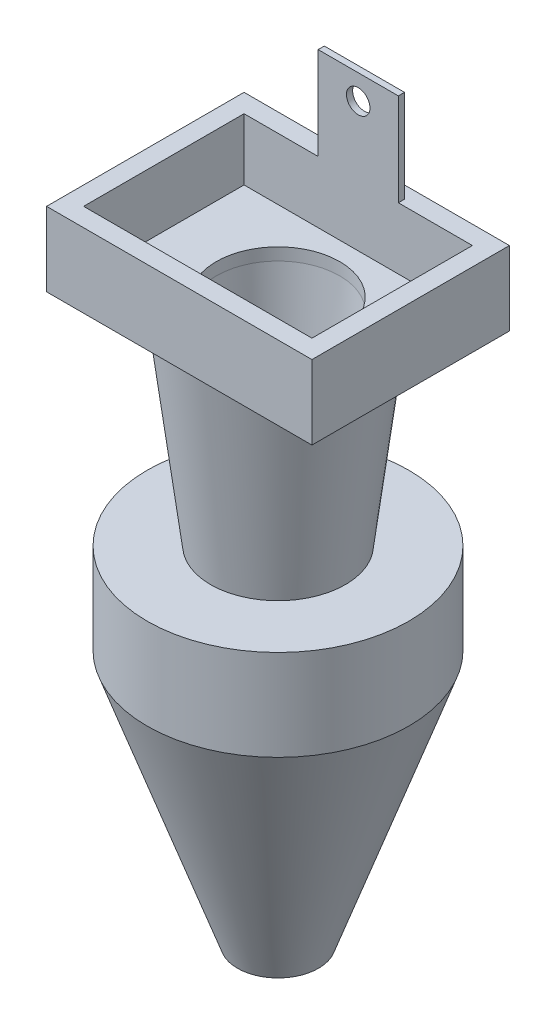
ISO-10303-21;
HEADER;
FILE_DESCRIPTION(('STEP AP214'),'2;1');
FILE_NAME('part.step','',(''),(''),'','','');
FILE_SCHEMA(('AUTOMOTIVE_DESIGN { 1 0 10303 214 1 1 1 1 }'));
ENDSEC;
DATA;
#1=APPLICATION_CONTEXT('core data for automotive mechanical design processes');
#2=APPLICATION_PROTOCOL_DEFINITION('international standard','automotive_design',2000,#1);
#3=PRODUCT_CONTEXT('',#1,'mechanical');
#4=PRODUCT('Part','Part','',(#3));
#5=PRODUCT_RELATED_PRODUCT_CATEGORY('part','',(#4));
#6=PRODUCT_DEFINITION_FORMATION('','',#4);
#7=PRODUCT_DEFINITION_CONTEXT('part definition',#1,'design');
#8=PRODUCT_DEFINITION('design','',#6,#7);
#9=PRODUCT_DEFINITION_SHAPE('','',#8);
#10=(LENGTH_UNIT() NAMED_UNIT(*) SI_UNIT(.MILLI.,.METRE.));
#11=(NAMED_UNIT(*) PLANE_ANGLE_UNIT() SI_UNIT($,.RADIAN.));
#12=(NAMED_UNIT(*) SI_UNIT($,.STERADIAN.) SOLID_ANGLE_UNIT());
#13=UNCERTAINTY_MEASURE_WITH_UNIT(LENGTH_MEASURE(1.E-05),#10,'distance_accuracy_value','');
#14=(GEOMETRIC_REPRESENTATION_CONTEXT(3) GLOBAL_UNCERTAINTY_ASSIGNED_CONTEXT((#13)) GLOBAL_UNIT_ASSIGNED_CONTEXT((#10,
#11,#12)) REPRESENTATION_CONTEXT('',''));
#15=CARTESIAN_POINT('',(0.,0.,0.));
#16=DIRECTION('',(0.,0.,1.));
#17=DIRECTION('',(1.,0.,0.));
#18=AXIS2_PLACEMENT_3D('',#15,#16,#17);
#19=CARTESIAN_POINT('',(18.5,-90.9,-13.));
#20=DIRECTION('',(0.,1.,0.));
#21=DIRECTION('',(0.,0.,1.));
#22=AXIS2_PLACEMENT_3D('',#19,#20,#21);
#23=CONICAL_SURFACE('',#22,4.,0.123108803001342);
#24=CARTESIAN_POINT('',(18.5,-34.8699197297466,-13.));
#25=DIRECTION('',(0.,1.,0.));
#26=DIRECTION('',(0.,0.,1.));
#27=AXIS2_PLACEMENT_3D('',#24,#25,#26);
#28=CIRCLE('',#27,10.9328558264656);
#29=CARTESIAN_POINT('',(18.5,-34.8699197297466,-2.06714417353444));
#30=VERTEX_POINT('',#29);
#31=EDGE_CURVE('E576',#30,#30,#28,.T.);
#32=ORIENTED_EDGE('',*,*,#31,.T.);
#33=EDGE_LOOP('',(#32));
#34=FACE_BOUND('',#33,.T.);
#35=CARTESIAN_POINT('',(18.5,-2.,-13.));
#36=DIRECTION('',(0.,1.,0.));
#37=DIRECTION('',(0.,0.,1.));
#38=AXIS2_PLACEMENT_3D('',#35,#36,#37);
#39=CIRCLE('',#38,15.);
#40=CARTESIAN_POINT('',(18.5,-2.,2.00000000000001));
#41=VERTEX_POINT('',#40);
#42=EDGE_CURVE('E274',#41,#41,#39,.T.);
#43=ORIENTED_EDGE('',*,*,#42,.F.);
#44=EDGE_LOOP('',(#43));
#45=FACE_BOUND('',#44,.T.);
#46=ADVANCED_FACE('F33',(#34,#45),#23,.T.);
#47=CARTESIAN_POINT('',(0.,10.,0.));
#48=DIRECTION('',(0.,-1.,0.));
#49=DIRECTION('',(0.,0.,-1.));
#50=AXIS2_PLACEMENT_3D('',#47,#48,#49);
#51=PLANE('',#50);
#52=DIRECTION('',(0.,0.,1.));
#53=VECTOR('',#52,1.);
#54=CARTESIAN_POINT('',(-3.,10.,3.));
#55=LINE('',#54,#53);
#56=CARTESIAN_POINT('',(-3.,10.,-29.));
#57=VERTEX_POINT('',#56);
#58=CARTESIAN_POINT('',(-3.,10.,3.));
#59=VERTEX_POINT('',#58);
#60=EDGE_CURVE('E220',#57,#59,#55,.T.);
#61=ORIENTED_EDGE('',*,*,#60,.T.);
#62=DIRECTION('',(1.,0.,0.));
#63=VECTOR('',#62,1.);
#64=CARTESIAN_POINT('',(-3.,10.,3.));
#65=LINE('',#64,#63);
#66=CARTESIAN_POINT('',(40.,10.,3.));
#67=VERTEX_POINT('',#66);
#68=EDGE_CURVE('E223',#59,#67,#65,.T.);
#69=ORIENTED_EDGE('',*,*,#68,.T.);
#70=DIRECTION('',(0.,0.,-1.));
#71=VECTOR('',#70,1.);
#72=CARTESIAN_POINT('',(40.,10.,3.));
#73=LINE('',#72,#71);
#74=CARTESIAN_POINT('',(40.,10.,-29.));
#75=VERTEX_POINT('',#74);
#76=EDGE_CURVE('E131',#67,#75,#73,.T.);
#77=ORIENTED_EDGE('',*,*,#76,.T.);
#78=DIRECTION('',(-1.,0.,0.));
#79=VECTOR('',#78,1.);
#80=CARTESIAN_POINT('',(-3.,10.,-29.));
#81=LINE('',#80,#79);
#82=EDGE_CURVE('E226',#75,#57,#81,.T.);
#83=ORIENTED_EDGE('',*,*,#82,.T.);
#84=EDGE_LOOP('',(#61,#69,#77,#83));
#85=FACE_BOUND('',#84,.T.);
#86=DIRECTION('',(0.,0.,-1.));
#87=VECTOR('',#86,1.);
#88=CARTESIAN_POINT('',(25.,10.,-26.));
#89=LINE('',#88,#87);
#90=CARTESIAN_POINT('',(25.,10.,-26.));
#91=VERTEX_POINT('',#90);
#92=CARTESIAN_POINT('',(25.,10.,-27.));
#93=VERTEX_POINT('',#92);
#94=EDGE_CURVE('E161',#91,#93,#89,.T.);
#95=ORIENTED_EDGE('',*,*,#94,.F.);
#96=DIRECTION('',(-1.,0.,0.));
#97=VECTOR('',#96,1.);
#98=CARTESIAN_POINT('',(0.,10.,-26.));
#99=LINE('',#98,#97);
#100=CARTESIAN_POINT('',(37.,10.,-26.));
#101=VERTEX_POINT('',#100);
#102=EDGE_CURVE('E198',#101,#91,#99,.T.);
#103=ORIENTED_EDGE('',*,*,#102,.F.);
#104=DIRECTION('',(0.,0.,-1.));
#105=VECTOR('',#104,1.);
#106=CARTESIAN_POINT('',(37.,10.,0.));
#107=LINE('',#106,#105);
#108=CARTESIAN_POINT('',(37.,10.,0.));
#109=VERTEX_POINT('',#108);
#110=EDGE_CURVE('E195',#109,#101,#107,.T.);
#111=ORIENTED_EDGE('',*,*,#110,.F.);
#112=DIRECTION('',(1.,0.,0.));
#113=VECTOR('',#112,1.);
#114=CARTESIAN_POINT('',(0.,10.,0.));
#115=LINE('',#114,#113);
#116=CARTESIAN_POINT('',(0.,10.,0.));
#117=VERTEX_POINT('',#116);
#118=EDGE_CURVE('E192',#117,#109,#115,.T.);
#119=ORIENTED_EDGE('',*,*,#118,.F.);
#120=DIRECTION('',(0.,0.,1.));
#121=VECTOR('',#120,1.);
#122=CARTESIAN_POINT('',(0.,10.,0.));
#123=LINE('',#122,#121);
#124=CARTESIAN_POINT('',(0.,10.,-26.));
#125=VERTEX_POINT('',#124);
#126=EDGE_CURVE('E190',#125,#117,#123,.T.);
#127=ORIENTED_EDGE('',*,*,#126,.F.);
#128=CARTESIAN_POINT('',(12.,10.,-26.));
#129=VERTEX_POINT('',#128);
#130=EDGE_CURVE('E59',#129,#125,#99,.T.);
#131=ORIENTED_EDGE('',*,*,#130,.F.);
#132=DIRECTION('',(0.,0.,1.));
#133=VECTOR('',#132,1.);
#134=CARTESIAN_POINT('',(12.,10.,-26.));
#135=LINE('',#134,#133);
#136=CARTESIAN_POINT('',(12.,10.,-27.));
#137=VERTEX_POINT('',#136);
#138=EDGE_CURVE('E168',#137,#129,#135,.T.);
#139=ORIENTED_EDGE('',*,*,#138,.F.);
#140=DIRECTION('',(-1.,0.,0.));
#141=VECTOR('',#140,1.);
#142=CARTESIAN_POINT('',(25.,10.,-27.));
#143=LINE('',#142,#141);
#144=EDGE_CURVE('E53',#93,#137,#143,.T.);
#145=ORIENTED_EDGE('',*,*,#144,.F.);
#146=EDGE_LOOP('',(#95,#103,#111,#119,#127,#131,#139,#145));
#147=FACE_BOUND('',#146,.T.);
#148=ADVANCED_FACE('F236',(#85,#147),#51,.F.);
#149=CARTESIAN_POINT('',(-3.,10.,3.));
#150=DIRECTION('',(1.,0.,0.));
#151=DIRECTION('',(0.,0.,-1.));
#152=AXIS2_PLACEMENT_3D('',#149,#150,#151);
#153=PLANE('',#152);
#154=DIRECTION('',(0.,-1.,0.));
#155=VECTOR('',#154,1.);
#156=CARTESIAN_POINT('',(-3.,10.,-29.));
#157=LINE('',#156,#155);
#158=CARTESIAN_POINT('',(-3.,-2.,-29.));
#159=VERTEX_POINT('',#158);
#160=EDGE_CURVE('E228',#57,#159,#157,.T.);
#161=ORIENTED_EDGE('',*,*,#160,.T.);
#162=DIRECTION('',(0.,0.,-1.));
#163=VECTOR('',#162,1.);
#164=CARTESIAN_POINT('',(-3.,-2.,-29.));
#165=LINE('',#164,#163);
#166=CARTESIAN_POINT('',(-3.,-2.,3.));
#167=VERTEX_POINT('',#166);
#168=EDGE_CURVE('E142',#167,#159,#165,.T.);
#169=ORIENTED_EDGE('',*,*,#168,.F.);
#170=DIRECTION('',(0.,-1.,0.));
#171=VECTOR('',#170,1.);
#172=CARTESIAN_POINT('',(-3.,10.,3.));
#173=LINE('',#172,#171);
#174=EDGE_CURVE('E11',#59,#167,#173,.T.);
#175=ORIENTED_EDGE('',*,*,#174,.F.);
#176=ORIENTED_EDGE('',*,*,#60,.F.);
#177=EDGE_LOOP('',(#161,#169,#175,#176));
#178=FACE_BOUND('',#177,.T.);
#179=ADVANCED_FACE('F35',(#178),#153,.F.);
#180=CARTESIAN_POINT('',(-3.,10.,3.));
#181=DIRECTION('',(0.,0.,-1.));
#182=DIRECTION('',(-1.,0.,0.));
#183=AXIS2_PLACEMENT_3D('',#180,#181,#182);
#184=PLANE('',#183);
#185=ORIENTED_EDGE('',*,*,#174,.T.);
#186=DIRECTION('',(-1.,0.,0.));
#187=VECTOR('',#186,1.);
#188=CARTESIAN_POINT('',(40.,-2.,3.));
#189=LINE('',#188,#187);
#190=CARTESIAN_POINT('',(40.,-2.,3.));
#191=VERTEX_POINT('',#190);
#192=EDGE_CURVE('E136',#191,#167,#189,.T.);
#193=ORIENTED_EDGE('',*,*,#192,.F.);
#194=DIRECTION('',(0.,-1.,0.));
#195=VECTOR('',#194,1.);
#196=CARTESIAN_POINT('',(40.,10.,3.));
#197=LINE('',#196,#195);
#198=EDGE_CURVE('E46',#67,#191,#197,.T.);
#199=ORIENTED_EDGE('',*,*,#198,.F.);
#200=ORIENTED_EDGE('',*,*,#68,.F.);
#201=EDGE_LOOP('',(#185,#193,#199,#200));
#202=FACE_BOUND('',#201,.T.);
#203=ADVANCED_FACE('F137',(#202),#184,.F.);
#204=CARTESIAN_POINT('',(40.,10.,3.));
#205=DIRECTION('',(-1.,0.,0.));
#206=DIRECTION('',(0.,0.,1.));
#207=AXIS2_PLACEMENT_3D('',#204,#205,#206);
#208=PLANE('',#207);
#209=ORIENTED_EDGE('',*,*,#198,.T.);
#210=DIRECTION('',(0.,0.,1.));
#211=VECTOR('',#210,1.);
#212=CARTESIAN_POINT('',(40.,-2.,-29.));
#213=LINE('',#212,#211);
#214=CARTESIAN_POINT('',(40.,-2.,-29.));
#215=VERTEX_POINT('',#214);
#216=EDGE_CURVE('E130',#215,#191,#213,.T.);
#217=ORIENTED_EDGE('',*,*,#216,.F.);
#218=DIRECTION('',(0.,-1.,0.));
#219=VECTOR('',#218,1.);
#220=CARTESIAN_POINT('',(40.,10.,-29.));
#221=LINE('',#220,#219);
#222=EDGE_CURVE('E133',#75,#215,#221,.T.);
#223=ORIENTED_EDGE('',*,*,#222,.F.);
#224=ORIENTED_EDGE('',*,*,#76,.F.);
#225=EDGE_LOOP('',(#209,#217,#223,#224));
#226=FACE_BOUND('',#225,.T.);
#227=ADVANCED_FACE('F127',(#226),#208,.F.);
#228=CARTESIAN_POINT('',(-3.,10.,-29.));
#229=DIRECTION('',(0.,0.,1.));
#230=DIRECTION('',(1.,0.,0.));
#231=AXIS2_PLACEMENT_3D('',#228,#229,#230);
#232=PLANE('',#231);
#233=ORIENTED_EDGE('',*,*,#222,.T.);
#234=DIRECTION('',(1.,0.,0.));
#235=VECTOR('',#234,1.);
#236=CARTESIAN_POINT('',(40.,-2.,-29.));
#237=LINE('',#236,#235);
#238=EDGE_CURVE('E147',#159,#215,#237,.T.);
#239=ORIENTED_EDGE('',*,*,#238,.F.);
#240=ORIENTED_EDGE('',*,*,#160,.F.);
#241=ORIENTED_EDGE('',*,*,#82,.F.);
#242=EDGE_LOOP('',(#233,#239,#240,#241));
#243=FACE_BOUND('',#242,.T.);
#244=ADVANCED_FACE('F232',(#243),#232,.F.);
#245=CARTESIAN_POINT('',(0.,10.,0.));
#246=DIRECTION('',(1.,0.,0.));
#247=DIRECTION('',(0.,0.,-1.));
#248=AXIS2_PLACEMENT_3D('',#245,#246,#247);
#249=PLANE('',#248);
#250=DIRECTION('',(0.,0.,1.));
#251=VECTOR('',#250,1.);
#252=CARTESIAN_POINT('',(0.,0.,0.));
#253=LINE('',#252,#251);
#254=CARTESIAN_POINT('',(0.,0.,-26.));
#255=VERTEX_POINT('',#254);
#256=CARTESIAN_POINT('',(0.,0.,0.));
#257=VERTEX_POINT('',#256);
#258=EDGE_CURVE('E189',#255,#257,#253,.T.);
#259=ORIENTED_EDGE('',*,*,#258,.F.);
#260=DIRECTION('',(0.,-1.,0.));
#261=VECTOR('',#260,1.);
#262=CARTESIAN_POINT('',(0.,10.,-26.));
#263=LINE('',#262,#261);
#264=EDGE_CURVE('E201',#125,#255,#263,.T.);
#265=ORIENTED_EDGE('',*,*,#264,.F.);
#266=ORIENTED_EDGE('',*,*,#126,.T.);
#267=DIRECTION('',(0.,-1.,0.));
#268=VECTOR('',#267,1.);
#269=CARTESIAN_POINT('',(0.,10.,0.));
#270=LINE('',#269,#268);
#271=EDGE_CURVE('E217',#117,#257,#270,.T.);
#272=ORIENTED_EDGE('',*,*,#271,.T.);
#273=EDGE_LOOP('',(#259,#265,#266,#272));
#274=FACE_BOUND('',#273,.T.);
#275=ADVANCED_FACE('F301',(#274),#249,.T.);
#276=CARTESIAN_POINT('',(0.,10.,0.));
#277=DIRECTION('',(0.,0.,-1.));
#278=DIRECTION('',(-1.,0.,0.));
#279=AXIS2_PLACEMENT_3D('',#276,#277,#278);
#280=PLANE('',#279);
#281=DIRECTION('',(1.,0.,0.));
#282=VECTOR('',#281,1.);
#283=CARTESIAN_POINT('',(0.,0.,0.));
#284=LINE('',#283,#282);
#285=CARTESIAN_POINT('',(37.,0.,0.));
#286=VERTEX_POINT('',#285);
#287=EDGE_CURVE('E204',#257,#286,#284,.T.);
#288=ORIENTED_EDGE('',*,*,#287,.F.);
#289=ORIENTED_EDGE('',*,*,#271,.F.);
#290=ORIENTED_EDGE('',*,*,#118,.T.);
#291=DIRECTION('',(0.,-1.,0.));
#292=VECTOR('',#291,1.);
#293=CARTESIAN_POINT('',(37.,10.,0.));
#294=LINE('',#293,#292);
#295=EDGE_CURVE('E215',#109,#286,#294,.T.);
#296=ORIENTED_EDGE('',*,*,#295,.T.);
#297=EDGE_LOOP('',(#288,#289,#290,#296));
#298=FACE_BOUND('',#297,.T.);
#299=ADVANCED_FACE('F305',(#298),#280,.T.);
#300=CARTESIAN_POINT('',(37.,10.,0.));
#301=DIRECTION('',(-1.,0.,0.));
#302=DIRECTION('',(0.,0.,1.));
#303=AXIS2_PLACEMENT_3D('',#300,#301,#302);
#304=PLANE('',#303);
#305=DIRECTION('',(0.,0.,-1.));
#306=VECTOR('',#305,1.);
#307=CARTESIAN_POINT('',(37.,0.,0.));
#308=LINE('',#307,#306);
#309=CARTESIAN_POINT('',(37.,0.,-26.));
#310=VERTEX_POINT('',#309);
#311=EDGE_CURVE('E207',#286,#310,#308,.T.);
#312=ORIENTED_EDGE('',*,*,#311,.F.);
#313=ORIENTED_EDGE('',*,*,#295,.F.);
#314=ORIENTED_EDGE('',*,*,#110,.T.);
#315=DIRECTION('',(0.,-1.,0.));
#316=VECTOR('',#315,1.);
#317=CARTESIAN_POINT('',(37.,10.,-26.));
#318=LINE('',#317,#316);
#319=EDGE_CURVE('E213',#101,#310,#318,.T.);
#320=ORIENTED_EDGE('',*,*,#319,.T.);
#321=EDGE_LOOP('',(#312,#313,#314,#320));
#322=FACE_BOUND('',#321,.T.);
#323=ADVANCED_FACE('F311',(#322),#304,.T.);
#324=CARTESIAN_POINT('',(0.,10.,-26.));
#325=DIRECTION('',(0.,0.,1.));
#326=DIRECTION('',(1.,0.,0.));
#327=AXIS2_PLACEMENT_3D('',#324,#325,#326);
#328=PLANE('',#327);
#329=CARTESIAN_POINT('',(18.5,21.,-26.));
#330=DIRECTION('',(0.,0.,1.));
#331=DIRECTION('',(1.,0.,0.));
#332=AXIS2_PLACEMENT_3D('',#329,#330,#331);
#333=CIRCLE('',#332,1.905);
#334=CARTESIAN_POINT('',(20.405,21.,-26.));
#335=VERTEX_POINT('',#334);
#336=EDGE_CURVE('E157',#335,#335,#333,.F.);
#337=ORIENTED_EDGE('',*,*,#336,.T.);
#338=EDGE_LOOP('',(#337));
#339=FACE_BOUND('',#338,.T.);
#340=DIRECTION('',(-1.,0.,0.));
#341=VECTOR('',#340,1.);
#342=CARTESIAN_POINT('',(0.,0.,-26.));
#343=LINE('',#342,#341);
#344=EDGE_CURVE('E193',#310,#255,#343,.T.);
#345=ORIENTED_EDGE('',*,*,#344,.F.);
#346=ORIENTED_EDGE('',*,*,#319,.F.);
#347=ORIENTED_EDGE('',*,*,#102,.T.);
#348=DIRECTION('',(0.,-1.,0.));
#349=VECTOR('',#348,1.);
#350=CARTESIAN_POINT('',(25.,25.,-26.));
#351=LINE('',#350,#349);
#352=CARTESIAN_POINT('',(25.,25.,-26.));
#353=VERTEX_POINT('',#352);
#354=EDGE_CURVE('E174',#353,#91,#351,.T.);
#355=ORIENTED_EDGE('',*,*,#354,.F.);
#356=DIRECTION('',(1.,0.,0.));
#357=VECTOR('',#356,1.);
#358=CARTESIAN_POINT('',(25.,25.,-26.));
#359=LINE('',#358,#357);
#360=CARTESIAN_POINT('',(12.,25.,-26.));
#361=VERTEX_POINT('',#360);
#362=EDGE_CURVE('E172',#361,#353,#359,.T.);
#363=ORIENTED_EDGE('',*,*,#362,.F.);
#364=DIRECTION('',(0.,-1.,0.));
#365=VECTOR('',#364,1.);
#366=CARTESIAN_POINT('',(12.,25.,-26.));
#367=LINE('',#366,#365);
#368=EDGE_CURVE('E181',#361,#129,#367,.T.);
#369=ORIENTED_EDGE('',*,*,#368,.T.);
#370=ORIENTED_EDGE('',*,*,#130,.T.);
#371=ORIENTED_EDGE('',*,*,#264,.T.);
#372=EDGE_LOOP('',(#345,#346,#347,#355,#363,#369,#370,#371));
#373=FACE_BOUND('',#372,.T.);
#374=ADVANCED_FACE('F313',(#339,#373),#328,.T.);
#375=CARTESIAN_POINT('',(25.,25.,-26.));
#376=DIRECTION('',(-1.,0.,0.));
#377=DIRECTION('',(0.,0.,1.));
#378=AXIS2_PLACEMENT_3D('',#375,#376,#377);
#379=PLANE('',#378);
#380=ORIENTED_EDGE('',*,*,#94,.T.);
#381=DIRECTION('',(0.,-1.,0.));
#382=VECTOR('',#381,1.);
#383=CARTESIAN_POINT('',(25.,25.,-27.));
#384=LINE('',#383,#382);
#385=CARTESIAN_POINT('',(25.,25.,-27.));
#386=VERTEX_POINT('',#385);
#387=EDGE_CURVE('E187',#386,#93,#384,.T.);
#388=ORIENTED_EDGE('',*,*,#387,.F.);
#389=DIRECTION('',(0.,0.,-1.));
#390=VECTOR('',#389,1.);
#391=CARTESIAN_POINT('',(25.,25.,-26.));
#392=LINE('',#391,#390);
#393=EDGE_CURVE('E164',#353,#386,#392,.T.);
#394=ORIENTED_EDGE('',*,*,#393,.F.);
#395=ORIENTED_EDGE('',*,*,#354,.T.);
#396=EDGE_LOOP('',(#380,#388,#394,#395));
#397=FACE_BOUND('',#396,.T.);
#398=ADVANCED_FACE('F326',(#397),#379,.F.);
#399=CARTESIAN_POINT('',(25.,25.,-27.));
#400=DIRECTION('',(0.,0.,1.));
#401=DIRECTION('',(1.,0.,0.));
#402=AXIS2_PLACEMENT_3D('',#399,#400,#401);
#403=PLANE('',#402);
#404=CARTESIAN_POINT('',(18.5,21.,-27.));
#405=DIRECTION('',(0.,0.,-1.));
#406=DIRECTION('',(-1.,0.,0.));
#407=AXIS2_PLACEMENT_3D('',#404,#405,#406);
#408=CIRCLE('',#407,1.905);
#409=CARTESIAN_POINT('',(16.595,21.,-27.));
#410=VERTEX_POINT('',#409);
#411=EDGE_CURVE('E158',#410,#410,#408,.T.);
#412=ORIENTED_EDGE('',*,*,#411,.F.);
#413=EDGE_LOOP('',(#412));
#414=FACE_BOUND('',#413,.T.);
#415=ORIENTED_EDGE('',*,*,#144,.T.);
#416=DIRECTION('',(0.,-1.,0.));
#417=VECTOR('',#416,1.);
#418=CARTESIAN_POINT('',(12.,25.,-27.));
#419=LINE('',#418,#417);
#420=CARTESIAN_POINT('',(12.,25.,-27.));
#421=VERTEX_POINT('',#420);
#422=EDGE_CURVE('E184',#421,#137,#419,.T.);
#423=ORIENTED_EDGE('',*,*,#422,.F.);
#424=DIRECTION('',(-1.,0.,0.));
#425=VECTOR('',#424,1.);
#426=CARTESIAN_POINT('',(25.,25.,-27.));
#427=LINE('',#426,#425);
#428=EDGE_CURVE('E167',#386,#421,#427,.T.);
#429=ORIENTED_EDGE('',*,*,#428,.F.);
#430=ORIENTED_EDGE('',*,*,#387,.T.);
#431=EDGE_LOOP('',(#415,#423,#429,#430));
#432=FACE_BOUND('',#431,.T.);
#433=ADVANCED_FACE('F322',(#414,#432),#403,.F.);
#434=CARTESIAN_POINT('',(12.,25.,-26.));
#435=DIRECTION('',(1.,0.,0.));
#436=DIRECTION('',(0.,0.,-1.));
#437=AXIS2_PLACEMENT_3D('',#434,#435,#436);
#438=PLANE('',#437);
#439=ORIENTED_EDGE('',*,*,#138,.T.);
#440=ORIENTED_EDGE('',*,*,#368,.F.);
#441=DIRECTION('',(0.,0.,1.));
#442=VECTOR('',#441,1.);
#443=CARTESIAN_POINT('',(12.,25.,-26.));
#444=LINE('',#443,#442);
#445=EDGE_CURVE('E170',#421,#361,#444,.T.);
#446=ORIENTED_EDGE('',*,*,#445,.F.);
#447=ORIENTED_EDGE('',*,*,#422,.T.);
#448=EDGE_LOOP('',(#439,#440,#446,#447));
#449=FACE_BOUND('',#448,.T.);
#450=ADVANCED_FACE('F319',(#449),#438,.F.);
#451=CARTESIAN_POINT('',(0.,25.,0.));
#452=DIRECTION('',(0.,1.,0.));
#453=DIRECTION('',(0.,0.,1.));
#454=AXIS2_PLACEMENT_3D('',#451,#452,#453);
#455=PLANE('',#454);
#456=ORIENTED_EDGE('',*,*,#393,.T.);
#457=ORIENTED_EDGE('',*,*,#428,.T.);
#458=ORIENTED_EDGE('',*,*,#445,.T.);
#459=ORIENTED_EDGE('',*,*,#362,.T.);
#460=EDGE_LOOP('',(#456,#457,#458,#459));
#461=FACE_BOUND('',#460,.T.);
#462=ADVANCED_FACE('F328',(#461),#455,.T.);
#463=CARTESIAN_POINT('',(18.5,21.,3.001));
#464=DIRECTION('',(0.,0.,-1.));
#465=DIRECTION('',(-1.,0.,0.));
#466=AXIS2_PLACEMENT_3D('',#463,#464,#465);
#467=CYLINDRICAL_SURFACE('',#466,1.905);
#468=ORIENTED_EDGE('',*,*,#336,.F.);
#469=EDGE_LOOP('',(#468));
#470=FACE_BOUND('',#469,.T.);
#471=ORIENTED_EDGE('',*,*,#411,.T.);
#472=EDGE_LOOP('',(#471));
#473=FACE_BOUND('',#472,.T.);
#474=ADVANCED_FACE('F295',(#470,#473),#467,.F.);
#475=CARTESIAN_POINT('',(0.,0.,0.));
#476=DIRECTION('',(0.,-1.,0.));
#477=DIRECTION('',(0.,0.,-1.));
#478=AXIS2_PLACEMENT_3D('',#475,#476,#477);
#479=PLANE('',#478);
#480=CARTESIAN_POINT('',(18.5,0.,-13.));
#481=DIRECTION('',(0.,-1.,0.));
#482=DIRECTION('',(0.,0.,-1.));
#483=AXIS2_PLACEMENT_3D('',#480,#481,#482);
#484=CIRCLE('',#483,10.);
#485=CARTESIAN_POINT('',(18.5,0.,-23.));
#486=VERTEX_POINT('',#485);
#487=EDGE_CURVE('E148',#486,#486,#484,.F.);
#488=ORIENTED_EDGE('',*,*,#487,.F.);
#489=EDGE_LOOP('',(#488));
#490=FACE_BOUND('',#489,.T.);
#491=ORIENTED_EDGE('',*,*,#258,.T.);
#492=ORIENTED_EDGE('',*,*,#287,.T.);
#493=ORIENTED_EDGE('',*,*,#311,.T.);
#494=ORIENTED_EDGE('',*,*,#344,.T.);
#495=EDGE_LOOP('',(#491,#492,#493,#494));
#496=FACE_BOUND('',#495,.T.);
#497=ADVANCED_FACE('F292',(#490,#496),#479,.F.);
#498=CARTESIAN_POINT('',(0.,-2.,0.));
#499=DIRECTION('',(0.,-1.,0.));
#500=DIRECTION('',(0.,0.,-1.));
#501=AXIS2_PLACEMENT_3D('',#498,#499,#500);
#502=PLANE('',#501);
#503=ORIENTED_EDGE('',*,*,#42,.T.);
#504=EDGE_LOOP('',(#503));
#505=FACE_BOUND('',#504,.T.);
#506=ORIENTED_EDGE('',*,*,#216,.T.);
#507=ORIENTED_EDGE('',*,*,#192,.T.);
#508=ORIENTED_EDGE('',*,*,#168,.T.);
#509=ORIENTED_EDGE('',*,*,#238,.T.);
#510=EDGE_LOOP('',(#506,#507,#508,#509));
#511=FACE_BOUND('',#510,.T.);
#512=ADVANCED_FACE('F145',(#505,#511),#502,.T.);
#513=CARTESIAN_POINT('',(18.5,25.001,-13.));
#514=DIRECTION('',(0.,-1.,0.));
#515=DIRECTION('',(0.,0.,-1.));
#516=AXIS2_PLACEMENT_3D('',#513,#514,#515);
#517=CYLINDRICAL_SURFACE('',#516,10.);
#518=CARTESIAN_POINT('',(18.5,-2.,-13.));
#519=DIRECTION('',(0.,1.,0.));
#520=DIRECTION('',(0.,0.,1.));
#521=AXIS2_PLACEMENT_3D('',#518,#519,#520);
#522=CIRCLE('',#521,10.);
#523=CARTESIAN_POINT('',(18.5,-2.,-2.99999999999999));
#524=VERTEX_POINT('',#523);
#525=EDGE_CURVE('E151',#524,#524,#522,.T.);
#526=ORIENTED_EDGE('',*,*,#525,.F.);
#527=EDGE_LOOP('',(#526));
#528=FACE_BOUND('',#527,.T.);
#529=ORIENTED_EDGE('',*,*,#487,.T.);
#530=EDGE_LOOP('',(#529));
#531=FACE_BOUND('',#530,.T.);
#532=ADVANCED_FACE('F286',(#528,#531),#517,.F.);
#533=CARTESIAN_POINT('',(18.5,-2.,-13.));
#534=DIRECTION('',(0.,1.,0.));
#535=DIRECTION('',(0.,0.,1.));
#536=AXIS2_PLACEMENT_3D('',#533,#534,#535);
#537=CONICAL_SURFACE('',#536,10.,0.0785780301848061);
#538=CARTESIAN_POINT('',(18.5,-90.9,-13.));
#539=DIRECTION('',(0.,1.,0.));
#540=DIRECTION('',(0.,0.,1.));
#541=AXIS2_PLACEMENT_3D('',#538,#539,#540);
#542=CIRCLE('',#541,3.);
#543=CARTESIAN_POINT('',(18.5,-90.9,-10.));
#544=VERTEX_POINT('',#543);
#545=EDGE_CURVE('E273',#544,#544,#542,.T.);
#546=ORIENTED_EDGE('',*,*,#545,.F.);
#547=EDGE_LOOP('',(#546));
#548=FACE_BOUND('',#547,.T.);
#549=ORIENTED_EDGE('',*,*,#525,.T.);
#550=EDGE_LOOP('',(#549));
#551=FACE_BOUND('',#550,.T.);
#552=ADVANCED_FACE('F264',(#548,#551),#537,.F.);
#553=CARTESIAN_POINT('',(21.5,-90.9,-13.));
#554=DIRECTION('',(0.,1.,0.));
#555=DIRECTION('',(0.,0.,1.));
#556=AXIS2_PLACEMENT_3D('',#553,#554,#555);
#557=PLANE('',#556);
#558=CARTESIAN_POINT('',(18.5,-90.9,-13.));
#559=DIRECTION('',(0.,1.,0.));
#560=DIRECTION('',(0.,0.,1.));
#561=AXIS2_PLACEMENT_3D('',#558,#559,#560);
#562=CIRCLE('',#561,4.);
#563=CARTESIAN_POINT('',(18.5,-90.9,-9.));
#564=VERTEX_POINT('',#563);
#565=EDGE_CURVE('E272',#564,#564,#562,.T.);
#566=ORIENTED_EDGE('',*,*,#565,.F.);
#567=EDGE_LOOP('',(#566));
#568=FACE_BOUND('',#567,.T.);
#569=ORIENTED_EDGE('',*,*,#545,.T.);
#570=EDGE_LOOP('',(#569));
#571=FACE_BOUND('',#570,.T.);
#572=ADVANCED_FACE('F256',(#568,#571),#557,.F.);
#573=CARTESIAN_POINT('',(18.5,-38.3930271406343,-13.));
#574=DIRECTION('',(0.,1.,0.));
#575=DIRECTION('',(0.,0.,1.));
#576=AXIS2_PLACEMENT_3D('',#573,#574,#575);
#577=CIRCLE('',#576,10.4969257756246);
#578=CARTESIAN_POINT('',(18.5,-38.3930271406343,-2.50307422437544));
#579=VERTEX_POINT('',#578);
#580=EDGE_CURVE('E269',#579,#579,#577,.T.);
#581=ORIENTED_EDGE('',*,*,#580,.F.);
#582=EDGE_LOOP('',(#581));
#583=FACE_BOUND('',#582,.T.);
#584=ORIENTED_EDGE('',*,*,#565,.T.);
#585=EDGE_LOOP('',(#584));
#586=FACE_BOUND('',#585,.T.);
#587=ADVANCED_FACE('F247',(#583,#586),#23,.T.);
#588=CARTESIAN_POINT('',(11.9355839531214,-90.9,-13.));
#589=DIRECTION('',(0.,-1.,0.));
#590=DIRECTION('',(0.,0.,-1.));
#591=AXIS2_PLACEMENT_3D('',#588,#589,#590);
#592=PLANE('',#591);
#593=CARTESIAN_POINT('',(18.5,-90.9,-13.));
#594=DIRECTION('',(0.,1.,0.));
#595=DIRECTION('',(0.,0.,1.));
#596=AXIS2_PLACEMENT_3D('',#593,#594,#595);
#597=CIRCLE('',#596,5.51143905867214);
#598=CARTESIAN_POINT('',(18.5,-90.9,-7.48856094132786));
#599=VERTEX_POINT('',#598);
#600=EDGE_CURVE('E561',#599,#599,#597,.T.);
#601=ORIENTED_EDGE('',*,*,#600,.T.);
#602=EDGE_LOOP('',(#601));
#603=FACE_BOUND('',#602,.T.);
#604=CARTESIAN_POINT('',(18.5,-90.9,-13.));
#605=DIRECTION('',(0.,1.,0.));
#606=DIRECTION('',(0.,0.,1.));
#607=AXIS2_PLACEMENT_3D('',#604,#605,#606);
#608=CIRCLE('',#607,6.5644160468786);
#609=CARTESIAN_POINT('',(18.5,-90.9,-6.4355839531214));
#610=VERTEX_POINT('',#609);
#611=EDGE_CURVE('E279',#610,#610,#608,.T.);
#612=ORIENTED_EDGE('',*,*,#611,.F.);
#613=EDGE_LOOP('',(#612));
#614=FACE_BOUND('',#613,.T.);
#615=ADVANCED_FACE('F255',(#603,#614),#592,.T.);
#616=CARTESIAN_POINT('',(18.5,-49.5930457447751,-13.));
#617=DIRECTION('',(0.,1.,0.));
#618=DIRECTION('',(0.,0.,1.));
#619=AXIS2_PLACEMENT_3D('',#616,#617,#618);
#620=CONICAL_SURFACE('',#619,21.196890299462,0.340444919898972);
#621=ORIENTED_EDGE('',*,*,#611,.T.);
#622=EDGE_LOOP('',(#621));
#623=FACE_BOUND('',#622,.T.);
#624=CARTESIAN_POINT('',(18.5,-49.5930457447751,-13.));
#625=DIRECTION('',(0.,1.,0.));
#626=DIRECTION('',(0.,0.,1.));
#627=AXIS2_PLACEMENT_3D('',#624,#625,#626);
#628=CIRCLE('',#627,21.196890299462);
#629=CARTESIAN_POINT('',(18.5,-49.5930457447751,8.19689029946205));
#630=VERTEX_POINT('',#629);
#631=EDGE_CURVE('E581',#630,#630,#628,.T.);
#632=ORIENTED_EDGE('',*,*,#631,.F.);
#633=EDGE_LOOP('',(#632));
#634=FACE_BOUND('',#633,.T.);
#635=ADVANCED_FACE('F262',(#623,#634),#620,.T.);
#636=CARTESIAN_POINT('',(18.5,-2.,-13.));
#637=DIRECTION('',(0.,1.,0.));
#638=DIRECTION('',(0.,0.,1.));
#639=AXIS2_PLACEMENT_3D('',#636,#637,#638);
#640=CYLINDRICAL_SURFACE('',#639,21.196890299462);
#641=CARTESIAN_POINT('',(-2.69684836335107,-43.6108890840217,-13.0421643039706));
#642=CARTESIAN_POINT('',(-2.69685018281267,-43.432553243579,-13.0421713781612));
#643=CARTESIAN_POINT('',(-2.69683493709821,-43.2541145347159,-13.0572372755652));
#644=CARTESIAN_POINT('',(-2.69658711096185,-42.9021782740131,-13.1171200038363));
#645=CARTESIAN_POINT('',(-2.69635432031524,-42.7286856689842,-13.1619656002031));
#646=CARTESIAN_POINT('',(-2.69512102955469,-42.391740751231,-13.2801329684168));
#647=CARTESIAN_POINT('',(-2.69412079676408,-42.2282849637872,-13.3534448202138));
#648=CARTESIAN_POINT('',(-2.69052774137532,-41.9160457929469,-13.5264425529514));
#649=CARTESIAN_POINT('',(-2.68793523604776,-41.7672594934128,-13.6261231774919));
#650=CARTESIAN_POINT('',(-2.68017703677059,-41.4886898252249,-13.8489008856433));
#651=CARTESIAN_POINT('',(-2.67501370490151,-41.3588891539144,-13.9719764099178));
#652=CARTESIAN_POINT('',(-2.66112328807,-41.1218321191261,-14.2380321913969));
#653=CARTESIAN_POINT('',(-2.65239623913977,-41.0145755277251,-14.38101224734));
#654=CARTESIAN_POINT('',(-2.63057978113789,-40.8260030891221,-14.6820863384424));
#655=CARTESIAN_POINT('',(-2.61750737391181,-40.7445885210551,-14.8401197820855));
#656=CARTESIAN_POINT('',(-2.5864579105841,-40.6093343363983,-15.1671171394777));
#657=CARTESIAN_POINT('',(-2.56848098455981,-40.5554939885959,-15.3360807632466));
#658=CARTESIAN_POINT('',(-2.52750655250482,-40.4767039385027,-15.6799402460739));
#659=CARTESIAN_POINT('',(-2.50451116668506,-40.4517420635436,-15.8548335736602));
#660=CARTESIAN_POINT('',(-2.45383796627486,-40.4310498528016,-16.2056591049217));
#661=CARTESIAN_POINT('',(-2.42615985729736,-40.4353213554893,-16.3815913732402));
#662=CARTESIAN_POINT('',(-2.36654438918044,-40.4728863961908,-16.7319527895774));
#663=CARTESIAN_POINT('',(-2.33455654625471,-40.5065547935764,-16.9063330223135));
#664=CARTESIAN_POINT('',(-2.26787436979613,-40.6022137604233,-17.2466035869822));
#665=CARTESIAN_POINT('',(-2.23317964296683,-40.6642084519294,-17.412492679375));
#666=CARTESIAN_POINT('',(-2.16192088095128,-40.8164236134669,-17.7350917079556));
#667=CARTESIAN_POINT('',(-2.12533238299519,-40.9072451285909,-17.8915128636477));
#668=CARTESIAN_POINT('',(-2.05304786264628,-41.1142033306141,-18.186861699083));
#669=CARTESIAN_POINT('',(-2.01735194003519,-41.2303428338533,-18.3257874299435));
#670=CARTESIAN_POINT('',(-1.94875783457397,-41.4860947545704,-18.5834052653795));
#671=CARTESIAN_POINT('',(-1.91588650209199,-41.6259013913025,-18.7019120931076));
#672=CARTESIAN_POINT('',(-1.85559093911391,-41.924607036607,-18.9135629612926));
#673=CARTESIAN_POINT('',(-1.82816590227677,-42.0835032133143,-19.0067107569917));
#674=CARTESIAN_POINT('',(-1.78147639592103,-42.4117944358989,-19.1624958040141));
#675=CARTESIAN_POINT('',(-1.76202536726284,-42.5808285535145,-19.2258364044071));
#676=CARTESIAN_POINT('',(-1.73189729118454,-42.9279022499325,-19.3230624044528));
#677=CARTESIAN_POINT('',(-1.72121752572725,-43.1059390208267,-19.3569569290374));
#678=CARTESIAN_POINT('',(-1.70978490969309,-43.4579775967265,-19.3932068569105));
#679=CARTESIAN_POINT('',(-1.70863669401012,-43.6318380929624,-19.3968184508921));
#680=CARTESIAN_POINT('',(-1.7153206527792,-43.9776343133367,-19.3756639244421));
#681=CARTESIAN_POINT('',(-1.72315190243872,-44.1495702338451,-19.3509007263223));
#682=CARTESIAN_POINT('',(-1.74697756702108,-44.4839026220971,-19.2745202762762));
#683=CARTESIAN_POINT('',(-1.76284248137395,-44.6464061866618,-19.2233287934083));
#684=CARTESIAN_POINT('',(-1.80149462170201,-44.9604587551706,-19.0960538570996));
#685=CARTESIAN_POINT('',(-1.82428266944646,-45.1120064560194,-19.0199674485727));
#686=CARTESIAN_POINT('',(-1.8759011486222,-45.4042310850241,-18.8429021347692));
#687=CARTESIAN_POINT('',(-1.90487457781406,-45.5445178892356,-18.7413218520652));
#688=CARTESIAN_POINT('',(-1.9665942887279,-45.8063134733773,-18.5172600372692));
#689=CARTESIAN_POINT('',(-1.99934138658687,-45.9278181779205,-18.3947739810881));
#690=CARTESIAN_POINT('',(-2.06805672222446,-46.1537715527798,-18.126702798306));
#691=CARTESIAN_POINT('',(-2.10410189414921,-46.2573209044232,-17.9803785562692));
#692=CARTESIAN_POINT('',(-2.17611722573828,-46.4384025431105,-17.6724004675002));
#693=CARTESIAN_POINT('',(-2.21208737531917,-46.5159315318945,-17.5107446807178));
#694=CARTESIAN_POINT('',(-2.2827473942972,-46.6439966464629,-17.1732250068672));
#695=CARTESIAN_POINT('',(-2.31740136718423,-46.6940080078613,-16.9971539103879));
#696=CARTESIAN_POINT('',(-2.38309212453029,-46.7631202239386,-16.6383864124632));
#697=CARTESIAN_POINT('',(-2.41412916770563,-46.782223290726,-16.4556904861142));
#698=CARTESIAN_POINT('',(-2.4710561059921,-46.7885547255282,-16.0913618123243));
#699=CARTESIAN_POINT('',(-2.49700746478465,-46.7761927619352,-15.9097459463503));
#700=CARTESIAN_POINT('',(-2.54364853525333,-46.720451678119,-15.5506456658248));
#701=CARTESIAN_POINT('',(-2.56433892538008,-46.6770765600821,-15.3731607212373));
#702=CARTESIAN_POINT('',(-2.59999340894518,-46.5616178923145,-15.031578219542));
#703=CARTESIAN_POINT('',(-2.61507336037633,-46.4901862453835,-14.8672721659191));
#704=CARTESIAN_POINT('',(-2.6405321756809,-46.3205411303985,-14.5527328438726));
#705=CARTESIAN_POINT('',(-2.65091143064119,-46.2223298914331,-14.4024984055489));
#706=CARTESIAN_POINT('',(-2.66764045515175,-46.0029749687778,-14.1219422848672));
#707=CARTESIAN_POINT('',(-2.67402832693966,-45.8820629238687,-13.9914416162465));
#708=CARTESIAN_POINT('',(-2.68387275880293,-45.6200738806119,-13.7523614408527));
#709=CARTESIAN_POINT('',(-2.68732871795371,-45.4789927553317,-13.6437864314339));
#710=CARTESIAN_POINT('',(-2.69230213647068,-45.1802983264032,-13.4514406376178));
#711=CARTESIAN_POINT('',(-2.69381456785612,-45.022643279365,-13.3677346181251));
#712=CARTESIAN_POINT('',(-2.69578096048129,-44.6956487111742,-13.2279367114796));
#713=CARTESIAN_POINT('',(-2.69623591855713,-44.5263203491713,-13.1718188574988));
#714=CARTESIAN_POINT('',(-2.69666889291413,-44.2320881032205,-13.1010150542783));
#715=CARTESIAN_POINT('',(-2.69674833475371,-44.1089007518905,-13.0789776495318));
#716=CARTESIAN_POINT('',(-2.69683743254106,-43.8607888044165,-13.0495497757438));
#717=CARTESIAN_POINT('',(-2.69684708829929,-43.7358642035552,-13.0421593464824));
#718=CARTESIAN_POINT('',(-2.69684836335107,-43.6108890840217,-13.0421643039706));
#719=B_SPLINE_CURVE_WITH_KNOTS('',3,(#641,#642,#643,#644,#645,#646,#647,#648,#649,#650,#651,
#652,#653,#654,#655,#656,#657,#658,#659,#660,#661,#662,#663,#664,#665,#666,#667,#668,#669,#670,
#671,#672,#673,#674,#675,#676,#677,#678,#679,#680,#681,#682,#683,#684,#685,#686,#687,#688,#689,
#690,#691,#692,#693,#694,#695,#696,#697,#698,#699,#700,#701,#702,#703,#704,#705,#706,#707,#708,
#709,#710,#711,#712,#713,#714,#715,#716,#717,#718),.UNSPECIFIED.,.T.,.F.,(4,2,2,2,2,2,2,2,2,2,2,
2,2,2,2,2,2,2,2,2,2,2,2,2,2,2,2,2,2,2,2,2,2,2,2,2,2,2,4),(0.,0.534555081435444,1.06962726531387,
1.60451315191791,2.13929249362008,2.67358138322412,3.20786487084681,3.74008203126338,
4.27228507762144,4.80426371134068,5.33627580120393,5.87517266980961,6.41414798372235,
6.96519410203012,7.51630154929532,8.07217269694296,8.62796148467784,9.1698812850241,
9.71163309194937,10.2307948261861,10.7499030969087,11.2608978815112,11.7719533444157,
12.2964332498862,12.8210267990509,13.3670465347644,13.9131354561182,14.4693062116314,
15.0254371602104,15.5743645351199,16.1232210848196,16.6600149137297,17.1967640744493,
17.7283077759689,18.2599603963389,18.7929856715877,19.3255082819341,19.7001155599443,
20.0747238553592),.UNSPECIFIED.);
#720=CARTESIAN_POINT('',(-2.69684836335107,-43.6108890840217,-13.0421643039706));
#721=VERTEX_POINT('',#720);
#722=EDGE_CURVE('E557',#721,#721,#719,.T.);
#723=ORIENTED_EDGE('',*,*,#722,.F.);
#724=EDGE_LOOP('',(#723));
#725=FACE_BOUND('',#724,.T.);
#726=ORIENTED_EDGE('',*,*,#631,.T.);
#727=EDGE_LOOP('',(#726));
#728=FACE_BOUND('',#727,.T.);
#729=CARTESIAN_POINT('',(18.5,-34.8699197297466,-13.));
#730=DIRECTION('',(0.,1.,0.));
#731=DIRECTION('',(0.,0.,1.));
#732=AXIS2_PLACEMENT_3D('',#729,#730,#731);
#733=CIRCLE('',#732,21.196890299462);
#734=CARTESIAN_POINT('',(18.5,-34.8699197297466,8.19689029946205));
#735=VERTEX_POINT('',#734);
#736=EDGE_CURVE('E578',#735,#735,#733,.T.);
#737=ORIENTED_EDGE('',*,*,#736,.F.);
#738=EDGE_LOOP('',(#737));
#739=FACE_BOUND('',#738,.T.);
#740=ADVANCED_FACE('F480',(#725,#728,#739),#640,.T.);
#741=CARTESIAN_POINT('',(-2.69689029946205,-34.8699197297466,-13.));
#742=DIRECTION('',(0.,1.,0.));
#743=DIRECTION('',(0.,0.,1.));
#744=AXIS2_PLACEMENT_3D('',#741,#742,#743);
#745=PLANE('',#744);
#746=ORIENTED_EDGE('',*,*,#736,.T.);
#747=EDGE_LOOP('',(#746));
#748=FACE_BOUND('',#747,.T.);
#749=ORIENTED_EDGE('',*,*,#31,.F.);
#750=EDGE_LOOP('',(#749));
#751=FACE_BOUND('',#750,.T.);
#752=ADVANCED_FACE('F490',(#748,#751),#745,.T.);
#753=CARTESIAN_POINT('',(8.00307422437544,-38.3930271406343,-13.));
#754=DIRECTION('',(0.,-1.,0.));
#755=DIRECTION('',(0.,0.,-1.));
#756=AXIS2_PLACEMENT_3D('',#753,#754,#755);
#757=PLANE('',#756);
#758=ORIENTED_EDGE('',*,*,#580,.T.);
#759=EDGE_LOOP('',(#758));
#760=FACE_BOUND('',#759,.T.);
#761=CARTESIAN_POINT('',(18.5,-38.3930271406343,-13.));
#762=DIRECTION('',(0.,1.,0.));
#763=DIRECTION('',(0.,0.,1.));
#764=AXIS2_PLACEMENT_3D('',#761,#762,#763);
#765=CIRCLE('',#764,18.1210066411769);
#766=CARTESIAN_POINT('',(18.5,-38.3930271406343,5.12100664117693));
#767=VERTEX_POINT('',#766);
#768=EDGE_CURVE('E572',#767,#767,#765,.T.);
#769=ORIENTED_EDGE('',*,*,#768,.F.);
#770=EDGE_LOOP('',(#769));
#771=FACE_BOUND('',#770,.T.);
#772=ADVANCED_FACE('F500',(#760,#771),#757,.T.);
#773=CARTESIAN_POINT('',(18.5,-2.,-13.));
#774=DIRECTION('',(0.,1.,0.));
#775=DIRECTION('',(0.,0.,1.));
#776=AXIS2_PLACEMENT_3D('',#773,#774,#775);
#777=CYLINDRICAL_SURFACE('',#776,18.1210066411769);
#778=CARTESIAN_POINT('',(0.379042413242919,-43.6108890840217,-13.0421643039706));
#779=CARTESIAN_POINT('',(0.379040397402525,-43.7892227254448,-13.0421709854826));
#780=CARTESIAN_POINT('',(0.379058148058199,-43.9676497474845,-13.0572358735378));
#781=CARTESIAN_POINT('',(0.379347932249457,-44.3195531364597,-13.1171110853967));
#782=CARTESIAN_POINT('',(0.379620189835674,-44.493025002527,-13.1619476080515));
#783=CARTESIAN_POINT('',(0.381062385610057,-44.8299379249636,-13.2800924040156));
#784=CARTESIAN_POINT('',(0.382232053715083,-44.9933819833047,-13.353392107817));
#785=CARTESIAN_POINT('',(0.386433964102048,-45.3056003476044,-13.5263605000897));
#786=CARTESIAN_POINT('',(0.389465867928019,-45.4543773135638,-13.6260243950717));
#787=CARTESIAN_POINT('',(0.39853769290005,-45.7328671211497,-13.8487097387889));
#788=CARTESIAN_POINT('',(0.40457372247768,-45.8626043461997,-13.9717008420325));
#789=CARTESIAN_POINT('',(0.420810216516361,-46.0995333204018,-14.2375251843617));
#790=CARTESIAN_POINT('',(0.431010563550817,-46.2067257051506,-14.380357863874));
#791=CARTESIAN_POINT('',(0.456488151096473,-46.395045074703,-14.6808148966065));
#792=CARTESIAN_POINT('',(0.471738338220857,-46.4763065186161,-14.8383572840998));
#793=CARTESIAN_POINT('',(0.507944366650969,-46.6113790043386,-15.1641755051516));
#794=CARTESIAN_POINT('',(0.528900013392409,-46.665190982034,-15.332450972547));
#795=CARTESIAN_POINT('',(0.576641263989358,-46.7441235853872,-15.6746799219393));
#796=CARTESIAN_POINT('',(0.6034233693018,-46.7692613723803,-15.8486299435529));
#797=CARTESIAN_POINT('',(0.662427343786177,-46.7906316544556,-16.1973688573477));
#798=CARTESIAN_POINT('',(0.694649666915349,-46.7868617361765,-16.3721578183505));
#799=CARTESIAN_POINT('',(0.764219065846124,-46.7506570867876,-16.7209039050846));
#800=CARTESIAN_POINT('',(0.801646005883926,-46.7177215250868,-16.894792859087));
#801=CARTESIAN_POINT('',(0.879728738081507,-46.62378621803,-17.2340592613453));
#802=CARTESIAN_POINT('',(0.920385143750699,-46.5627811296378,-17.3994350824592));
#803=CARTESIAN_POINT('',(1.00435140858285,-46.4122026593616,-17.7224861517246));
#804=CARTESIAN_POINT('',(1.04770442443906,-46.3218074753681,-17.8797675055297));
#805=CARTESIAN_POINT('',(1.13351603655787,-46.1154592149521,-18.1768779683057));
#806=CARTESIAN_POINT('',(1.17597447881875,-45.9995017767171,-18.31670409242));
#807=CARTESIAN_POINT('',(1.25792057496678,-45.7431688890218,-18.5767765007942));
#808=CARTESIAN_POINT('',(1.29736226437684,-45.6024947164066,-18.6967436552479));
#809=CARTESIAN_POINT('',(1.36982243317598,-45.3013427070352,-18.9110692378231));
#810=CARTESIAN_POINT('',(1.40284222950879,-45.1408689416558,-19.0054329180451));
#811=CARTESIAN_POINT('',(1.45881483704258,-44.810201435199,-19.1624376448692));
#812=CARTESIAN_POINT('',(1.48206863589161,-44.6405154928966,-19.2260380875775));
#813=CARTESIAN_POINT('',(1.51806599385074,-44.2917737006612,-19.3235707318309));
#814=CARTESIAN_POINT('',(1.53081437795648,-44.1127221924374,-19.3575165537756));
#815=CARTESIAN_POINT('',(1.54422987816042,-43.7615794763871,-19.3932052700112));
#816=CARTESIAN_POINT('',(1.54555776876756,-43.5896907533796,-19.3967095955499));
#817=CARTESIAN_POINT('',(1.53775254221952,-43.2478525561764,-19.3759834367633));
#818=CARTESIAN_POINT('',(1.52862080026913,-43.0779028300132,-19.3517565984581));
#819=CARTESIAN_POINT('',(1.50097435754094,-42.7485791797186,-19.2773812915769));
#820=CARTESIAN_POINT('',(1.48267077784135,-42.5890547562916,-19.2278155865084));
#821=CARTESIAN_POINT('',(1.438171945822,-42.2806697452521,-19.1048469856813));
#822=CARTESIAN_POINT('',(1.41197547803925,-42.1318108044407,-19.0314404184202));
#823=CARTESIAN_POINT('',(1.3524075875678,-41.8430305791345,-18.8599879335856));
#824=CARTESIAN_POINT('',(1.31880988011926,-41.7036312033505,-18.7611430429341));
#825=CARTESIAN_POINT('',(1.24723312874492,-41.4430595046923,-18.5431098153918));
#826=CARTESIAN_POINT('',(1.20925283300525,-41.3218924124518,-18.4239156613853));
#827=CARTESIAN_POINT('',(1.12887863440297,-41.0940561217515,-18.1609060143548));
#828=CARTESIAN_POINT('',(1.08635657495259,-40.9886005420425,-18.0160768824907));
#829=CARTESIAN_POINT('',(1.00129704752604,-40.8034623901976,-17.7107724105884));
#830=CARTESIAN_POINT('',(0.958759578154244,-40.723784554274,-17.5502942023455));
#831=CARTESIAN_POINT('',(0.874739668566611,-40.5906258484006,-17.2133106504172));
#832=CARTESIAN_POINT('',(0.83331505880961,-40.5378951540919,-17.0364932828999));
#833=CARTESIAN_POINT('',(0.754698344433868,-40.4637470882951,-16.675492974611));
#834=CARTESIAN_POINT('',(0.717505826655727,-40.4423266577092,-16.4913107552119));
#835=CARTESIAN_POINT('',(0.649374514245919,-40.432034601149,-16.1241499663397));
#836=CARTESIAN_POINT('',(0.618339214271557,-40.4426098286948,-15.9412051251555));
#837=CARTESIAN_POINT('',(0.562511361733341,-40.4953177400374,-15.5789453532899));
#838=CARTESIAN_POINT('',(0.537717662210317,-40.5374446202249,-15.3996297612736));
#839=CARTESIAN_POINT('',(0.495155307475378,-40.650610712082,-15.0556284718784));
#840=CARTESIAN_POINT('',(0.477195807319137,-40.7207309332549,-14.8906636091591));
#841=CARTESIAN_POINT('',(0.446826120242624,-40.8879788244077,-14.5744962561617));
#842=CARTESIAN_POINT('',(0.434415365886383,-40.9851037311368,-14.4232923598946));
#843=CARTESIAN_POINT('',(0.414416684922659,-41.2021119698675,-14.1411930186968));
#844=CARTESIAN_POINT('',(0.406764717131918,-41.3216635925494,-14.0100466539429));
#845=CARTESIAN_POINT('',(0.394932041842636,-41.5810389746756,-13.7693828193164));
#846=CARTESIAN_POINT('',(0.390751986532032,-41.7208665371002,-13.6598694160715));
#847=CARTESIAN_POINT('',(0.384705867879932,-42.0172862172871,-13.4653298508322));
#848=CARTESIAN_POINT('',(0.382847100094878,-42.1739295184142,-13.3803815338349));
#849=CARTESIAN_POINT('',(0.380413771627742,-42.4991193448891,-13.2378935155688));
#850=CARTESIAN_POINT('',(0.379838123159757,-42.6676556625683,-13.1803306304346));
#851=CARTESIAN_POINT('',(0.379275102144569,-42.9656908247389,-13.1056956630592));
#852=CARTESIAN_POINT('',(0.37917144081342,-43.0935511198096,-13.0819072620871));
#853=CARTESIAN_POINT('',(0.379055830123569,-43.3512207944489,-13.0501391178368));
#854=CARTESIAN_POINT('',(0.379043881136572,-43.4810301819148,-13.0421594386305));
#855=CARTESIAN_POINT('',(0.379042413242919,-43.6108890840217,-13.0421643039706));
#856=B_SPLINE_CURVE_WITH_KNOTS('',3,(#778,#779,#780,#781,#782,#783,#784,#785,#786,#787,#788,
#789,#790,#791,#792,#793,#794,#795,#796,#797,#798,#799,#800,#801,#802,#803,#804,#805,#806,#807,
#808,#809,#810,#811,#812,#813,#814,#815,#816,#817,#818,#819,#820,#821,#822,#823,#824,#825,#826,
#827,#828,#829,#830,#831,#832,#833,#834,#835,#836,#837,#838,#839,#840,#841,#842,#843,#844,#845,
#846,#847,#848,#849,#850,#851,#852,#853,#854,#855),.UNSPECIFIED.,.T.,.F.,(4,2,2,2,2,2,2,2,2,2,2,
2,2,2,2,2,2,2,2,2,2,2,2,2,2,2,2,2,2,2,2,2,2,2,2,2,2,2,4),(0.,0.53453210469232,1.06953521877169,
1.6043773823555,2.13912236867136,2.67317643804463,3.20721544905103,3.7384385432557,
4.26964352426585,4.80053041511912,5.3314616275739,5.87169066577292,6.41202257917234,
6.96899171826637,7.52605596939127,8.09038511630361,8.65459841339105,9.19985306696736,
9.74485715262177,10.2580994885643,10.7712743525088,11.2731448830454,11.775092738523,
12.2952948879265,12.8156459940005,13.3655387588566,13.9155324996489,14.480101115842,
15.0446145684615,15.5994247059078,16.1541328166627,16.6919579981383,17.2297281669665,
17.7600951506002,18.2905617395012,18.8226913658877,19.3543696986126,19.7436034425881,
20.1328387641028),.UNSPECIFIED.);
#857=CARTESIAN_POINT('',(0.379042413242919,-43.6108890840217,-13.0421643039706));
#858=VERTEX_POINT('',#857);
#859=EDGE_CURVE('E37',#858,#858,#856,.T.);
#860=ORIENTED_EDGE('',*,*,#859,.F.);
#861=EDGE_LOOP('',(#860));
#862=FACE_BOUND('',#861,.T.);
#863=ORIENTED_EDGE('',*,*,#768,.T.);
#864=EDGE_LOOP('',(#863));
#865=FACE_BOUND('',#864,.T.);
#866=CARTESIAN_POINT('',(18.5,-49.5930457447751,-13.));
#867=DIRECTION('',(0.,1.,0.));
#868=DIRECTION('',(0.,0.,1.));
#869=AXIS2_PLACEMENT_3D('',#866,#867,#868);
#870=CIRCLE('',#869,18.1210066411769);
#871=CARTESIAN_POINT('',(18.5,-49.5930457447751,5.12100664117693));
#872=VERTEX_POINT('',#871);
#873=EDGE_CURVE('E569',#872,#872,#870,.T.);
#874=ORIENTED_EDGE('',*,*,#873,.F.);
#875=EDGE_LOOP('',(#874));
#876=FACE_BOUND('',#875,.T.);
#877=ADVANCED_FACE('F509',(#862,#865,#876),#777,.F.);
#878=CARTESIAN_POINT('',(8.6331837686676,-49.5930457447751,-13.));
#879=DIRECTION('',(0.,1.,0.));
#880=DIRECTION('',(0.,0.,1.));
#881=AXIS2_PLACEMENT_3D('',#878,#879,#880);
#882=PLANE('',#881);
#883=ORIENTED_EDGE('',*,*,#873,.T.);
#884=EDGE_LOOP('',(#883));
#885=FACE_BOUND('',#884,.T.);
#886=CARTESIAN_POINT('',(18.5,-49.5930457447751,-13.));
#887=DIRECTION('',(0.,1.,0.));
#888=DIRECTION('',(0.,0.,1.));
#889=AXIS2_PLACEMENT_3D('',#886,#887,#888);
#890=CIRCLE('',#889,9.8668162313324);
#891=CARTESIAN_POINT('',(18.5,-49.5930457447751,-3.1331837686676));
#892=VERTEX_POINT('',#891);
#893=EDGE_CURVE('E566',#892,#892,#890,.T.);
#894=ORIENTED_EDGE('',*,*,#893,.F.);
#895=EDGE_LOOP('',(#894));
#896=FACE_BOUND('',#895,.T.);
#897=ADVANCED_FACE('F518',(#885,#896),#882,.T.);
#898=CARTESIAN_POINT('',(18.5,-90.9,-13.));
#899=DIRECTION('',(0.,1.,0.));
#900=DIRECTION('',(0.,0.,1.));
#901=AXIS2_PLACEMENT_3D('',#898,#899,#900);
#902=CONICAL_SURFACE('',#901,5.51143905867214,0.105051167207706);
#903=ORIENTED_EDGE('',*,*,#893,.T.);
#904=EDGE_LOOP('',(#903));
#905=FACE_BOUND('',#904,.T.);
#906=ORIENTED_EDGE('',*,*,#600,.F.);
#907=EDGE_LOOP('',(#906));
#908=FACE_BOUND('',#907,.T.);
#909=ADVANCED_FACE('F526',(#905,#908),#902,.F.);
#910=CARTESIAN_POINT('',(2.,-43.6108890840217,-16.2171643039706));
#911=DIRECTION('',(-1.,0.,0.));
#912=DIRECTION('',(0.,0.,1.));
#913=AXIS2_PLACEMENT_3D('',#910,#911,#912);
#914=CYLINDRICAL_SURFACE('',#913,3.175);
#915=ORIENTED_EDGE('',*,*,#722,.T.);
#916=EDGE_LOOP('',(#915));
#917=FACE_BOUND('',#916,.T.);
#918=ORIENTED_EDGE('',*,*,#859,.T.);
#919=EDGE_LOOP('',(#918));
#920=FACE_BOUND('',#919,.T.);
#921=ADVANCED_FACE('F534',(#917,#920),#914,.F.);
#922=CLOSED_SHELL('',(#46,#148,#179,#203,#227,#244,#275,#299,#323,#374,#398,#433,#450,#462,#474,
#497,#512,#532,#552,#572,#587,#615,#635,#740,#752,#772,#877,#897,#909,#921));
#923=MANIFOLD_SOLID_BREP('B2',#922);
#924=ADVANCED_BREP_SHAPE_REPRESENTATION('',(#18,#923),#14);
#925=SHAPE_DEFINITION_REPRESENTATION(#9,#924);
ENDSEC;
END-ISO-10303-21;
